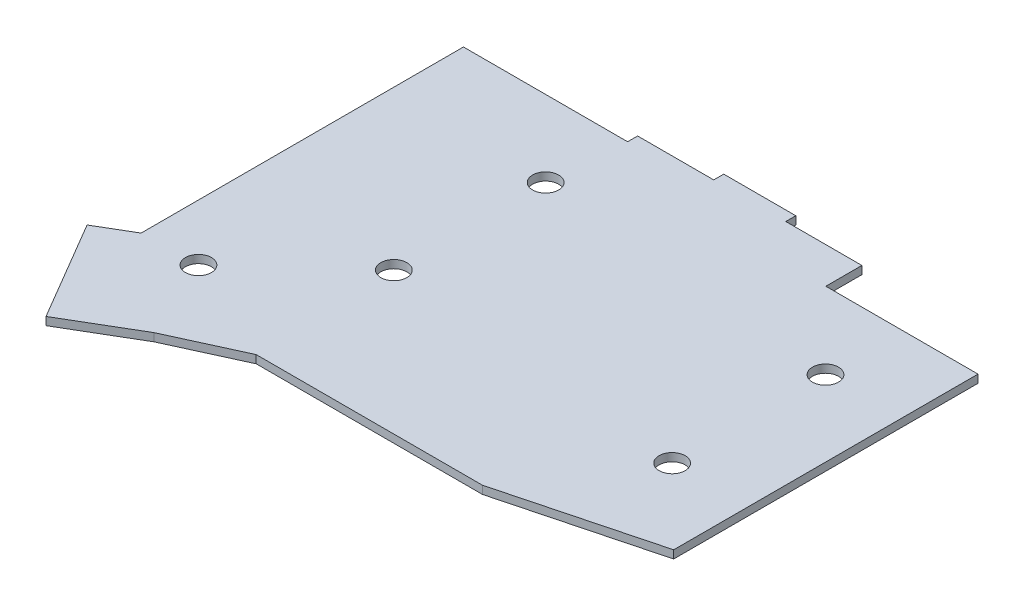
ISO-10303-21;
HEADER;
FILE_DESCRIPTION(('STEP AP214'),'2;1');
FILE_NAME('part.step','',(''),(''),'','','');
FILE_SCHEMA(('AUTOMOTIVE_DESIGN { 1 0 10303 214 1 1 1 1 }'));
ENDSEC;
DATA;
#1=APPLICATION_CONTEXT('core data for automotive mechanical design processes');
#2=APPLICATION_PROTOCOL_DEFINITION('international standard','automotive_design',2000,#1);
#3=PRODUCT_CONTEXT('',#1,'mechanical');
#4=PRODUCT('Part','Part','',(#3));
#5=PRODUCT_RELATED_PRODUCT_CATEGORY('part','',(#4));
#6=PRODUCT_DEFINITION_FORMATION('','',#4);
#7=PRODUCT_DEFINITION_CONTEXT('part definition',#1,'design');
#8=PRODUCT_DEFINITION('design','',#6,#7);
#9=PRODUCT_DEFINITION_SHAPE('','',#8);
#10=(LENGTH_UNIT() NAMED_UNIT(*) SI_UNIT(.MILLI.,.METRE.));
#11=(NAMED_UNIT(*) PLANE_ANGLE_UNIT() SI_UNIT($,.RADIAN.));
#12=(NAMED_UNIT(*) SI_UNIT($,.STERADIAN.) SOLID_ANGLE_UNIT());
#13=UNCERTAINTY_MEASURE_WITH_UNIT(LENGTH_MEASURE(1.E-05),#10,'distance_accuracy_value','');
#14=(GEOMETRIC_REPRESENTATION_CONTEXT(3) GLOBAL_UNCERTAINTY_ASSIGNED_CONTEXT((#13)) GLOBAL_UNIT_ASSIGNED_CONTEXT((#10,
#11,#12)) REPRESENTATION_CONTEXT('',''));
#15=CARTESIAN_POINT('',(0.,0.,0.));
#16=DIRECTION('',(0.,0.,1.));
#17=DIRECTION('',(1.,0.,0.));
#18=AXIS2_PLACEMENT_3D('',#15,#16,#17);
#19=CARTESIAN_POINT('',(0.,2.,0.));
#20=DIRECTION('',(0.,1.,0.));
#21=DIRECTION('',(0.,0.,1.));
#22=AXIS2_PLACEMENT_3D('',#19,#20,#21);
#23=PLANE('',#22);
#24=CARTESIAN_POINT('',(116.07,2.,25.658));
#25=DIRECTION('',(0.,1.,0.));
#26=DIRECTION('',(0.,0.,1.));
#27=AXIS2_PLACEMENT_3D('',#24,#25,#26);
#28=CIRCLE('',#27,3.25000000000001);
#29=CARTESIAN_POINT('',(116.07,2.,28.908));
#30=VERTEX_POINT('',#29);
#31=EDGE_CURVE('E362',#30,#30,#28,.T.);
#32=ORIENTED_EDGE('',*,*,#31,.F.);
#33=EDGE_LOOP('',(#32));
#34=FACE_BOUND('',#33,.T.);
#35=CARTESIAN_POINT('',(39.57,2.,56.958));
#36=DIRECTION('',(0.,1.,0.));
#37=DIRECTION('',(0.,0.,1.));
#38=AXIS2_PLACEMENT_3D('',#35,#36,#37);
#39=CIRCLE('',#38,3.25);
#40=CARTESIAN_POINT('',(39.57,2.,60.208));
#41=VERTEX_POINT('',#40);
#42=EDGE_CURVE('E374',#41,#41,#39,.T.);
#43=ORIENTED_EDGE('',*,*,#42,.F.);
#44=EDGE_LOOP('',(#43));
#45=FACE_BOUND('',#44,.T.);
#46=DIRECTION('',(-1.,0.,0.));
#47=VECTOR('',#46,1.);
#48=CARTESIAN_POINT('',(41.,2.,0.));
#49=LINE('',#48,#47);
#50=CARTESIAN_POINT('',(41.,2.,0.));
#51=VERTEX_POINT('',#50);
#52=CARTESIAN_POINT('',(0.,2.,0.));
#53=VERTEX_POINT('',#52);
#54=EDGE_CURVE('E219',#51,#53,#49,.T.);
#55=ORIENTED_EDGE('',*,*,#54,.T.);
#56=DIRECTION('',(0.,0.,1.));
#57=VECTOR('',#56,1.);
#58=CARTESIAN_POINT('',(0.,2.,0.));
#59=LINE('',#58,#57);
#60=CARTESIAN_POINT('',(0.,2.,80.5));
#61=VERTEX_POINT('',#60);
#62=EDGE_CURVE('E122',#53,#61,#59,.T.);
#63=ORIENTED_EDGE('',*,*,#62,.T.);
#64=DIRECTION('',(-0.861934215157769,0.,0.507020126563394));
#65=VECTOR('',#64,1.);
#66=CARTESIAN_POINT('',(0.,2.,80.5));
#67=LINE('',#66,#65);
#68=CARTESIAN_POINT('',(-8.5,2.,85.5));
#69=VERTEX_POINT('',#68);
#70=EDGE_CURVE('E261',#61,#69,#67,.T.);
#71=ORIENTED_EDGE('',*,*,#70,.T.);
#72=DIRECTION('',(0.507020126563394,0.,0.861934215157769));
#73=VECTOR('',#72,1.);
#74=CARTESIAN_POINT('',(-8.5,2.,85.5));
#75=LINE('',#74,#73);
#76=CARTESIAN_POINT('',(6.15323253246143,2.,110.410495305184));
#77=VERTEX_POINT('',#76);
#78=EDGE_CURVE('E280',#69,#77,#75,.T.);
#79=ORIENTED_EDGE('',*,*,#78,.T.);
#80=DIRECTION('',(0.861934215157769,0.,-0.507020126563395));
#81=VECTOR('',#80,1.);
#82=CARTESIAN_POINT('',(6.15323253246143,2.,110.410495305184));
#83=LINE('',#82,#81);
#84=CARTESIAN_POINT('',(23.1532325324614,2.,100.410495305184));
#85=VERTEX_POINT('',#84);
#86=EDGE_CURVE('E277',#77,#85,#83,.T.);
#87=ORIENTED_EDGE('',*,*,#86,.T.);
#88=DIRECTION('',(0.909474475585797,0.,-0.415759760267802));
#89=VECTOR('',#88,1.);
#90=CARTESIAN_POINT('',(23.1532325324614,2.,100.410495305184));
#91=LINE('',#90,#89);
#92=CARTESIAN_POINT('',(40.6532325324614,2.,92.4104953051842));
#93=VERTEX_POINT('',#92);
#94=EDGE_CURVE('E279',#85,#93,#91,.T.);
#95=ORIENTED_EDGE('',*,*,#94,.T.);
#96=DIRECTION('',(1.,0.,0.));
#97=VECTOR('',#96,1.);
#98=CARTESIAN_POINT('',(97.1532325324615,2.,92.4104953051843));
#99=LINE('',#98,#97);
#100=CARTESIAN_POINT('',(97.1532325324615,2.,92.4104953051843));
#101=VERTEX_POINT('',#100);
#102=EDGE_CURVE('E282',#93,#101,#99,.T.);
#103=ORIENTED_EDGE('',*,*,#102,.T.);
#104=DIRECTION('',(0.967383206480212,0.,-0.253317452655881));
#105=VECTOR('',#104,1.);
#106=CARTESIAN_POINT('',(135.,2.,82.5));
#107=LINE('',#106,#105);
#108=CARTESIAN_POINT('',(135.,2.,82.5));
#109=VERTEX_POINT('',#108);
#110=EDGE_CURVE('E288',#101,#109,#107,.T.);
#111=ORIENTED_EDGE('',*,*,#110,.T.);
#112=DIRECTION('',(0.,0.,-1.));
#113=VECTOR('',#112,1.);
#114=CARTESIAN_POINT('',(135.,2.,6.5));
#115=LINE('',#114,#113);
#116=CARTESIAN_POINT('',(135.,2.,6.5));
#117=VERTEX_POINT('',#116);
#118=EDGE_CURVE('E290',#109,#117,#115,.T.);
#119=ORIENTED_EDGE('',*,*,#118,.T.);
#120=DIRECTION('',(-1.,0.,0.));
#121=VECTOR('',#120,1.);
#122=CARTESIAN_POINT('',(97.,2.,6.5));
#123=LINE('',#122,#121);
#124=CARTESIAN_POINT('',(97.,2.,6.5));
#125=VERTEX_POINT('',#124);
#126=EDGE_CURVE('E292',#117,#125,#123,.T.);
#127=ORIENTED_EDGE('',*,*,#126,.T.);
#128=DIRECTION('',(0.,0.,-1.));
#129=VECTOR('',#128,1.);
#130=CARTESIAN_POINT('',(97.,2.,-2.5));
#131=LINE('',#130,#129);
#132=CARTESIAN_POINT('',(97.,2.,-2.5));
#133=VERTEX_POINT('',#132);
#134=EDGE_CURVE('E294',#125,#133,#131,.T.);
#135=ORIENTED_EDGE('',*,*,#134,.T.);
#136=DIRECTION('',(-1.,0.,0.));
#137=VECTOR('',#136,1.);
#138=CARTESIAN_POINT('',(78.,2.,-2.5));
#139=LINE('',#138,#137);
#140=CARTESIAN_POINT('',(78.,2.,-2.5));
#141=VERTEX_POINT('',#140);
#142=EDGE_CURVE('E296',#133,#141,#139,.T.);
#143=ORIENTED_EDGE('',*,*,#142,.T.);
#144=DIRECTION('',(0.,0.,-1.));
#145=VECTOR('',#144,1.);
#146=CARTESIAN_POINT('',(78.,2.,-5.));
#147=LINE('',#146,#145);
#148=CARTESIAN_POINT('',(78.,2.,-5.));
#149=VERTEX_POINT('',#148);
#150=EDGE_CURVE('E298',#141,#149,#147,.T.);
#151=ORIENTED_EDGE('',*,*,#150,.T.);
#152=DIRECTION('',(-1.,0.,0.));
#153=VECTOR('',#152,1.);
#154=CARTESIAN_POINT('',(60.,2.,-5.));
#155=LINE('',#154,#153);
#156=CARTESIAN_POINT('',(60.,2.,-5.));
#157=VERTEX_POINT('',#156);
#158=EDGE_CURVE('E168',#149,#157,#155,.T.);
#159=ORIENTED_EDGE('',*,*,#158,.T.);
#160=DIRECTION('',(0.,0.,1.));
#161=VECTOR('',#160,1.);
#162=CARTESIAN_POINT('',(60.,2.,-2.5));
#163=LINE('',#162,#161);
#164=CARTESIAN_POINT('',(60.,2.,-2.5));
#165=VERTEX_POINT('',#164);
#166=EDGE_CURVE('E162',#157,#165,#163,.T.);
#167=ORIENTED_EDGE('',*,*,#166,.T.);
#168=DIRECTION('',(-1.,0.,0.));
#169=VECTOR('',#168,1.);
#170=CARTESIAN_POINT('',(41.,2.,-2.5));
#171=LINE('',#170,#169);
#172=CARTESIAN_POINT('',(41.,2.,-2.5));
#173=VERTEX_POINT('',#172);
#174=EDGE_CURVE('E166',#165,#173,#171,.T.);
#175=ORIENTED_EDGE('',*,*,#174,.T.);
#176=DIRECTION('',(0.,0.,1.));
#177=VECTOR('',#176,1.);
#178=CARTESIAN_POINT('',(41.,2.,0.));
#179=LINE('',#178,#177);
#180=EDGE_CURVE('E52',#173,#51,#179,.T.);
#181=ORIENTED_EDGE('',*,*,#180,.T.);
#182=EDGE_LOOP('',(#55,#63,#71,#79,#87,#95,#103,#111,#119,#127,#135,#143,#151,#159,#167,#175,#181));
#183=FACE_BOUND('',#182,.T.);
#184=CARTESIAN_POINT('',(14.07,2.,80.258));
#185=DIRECTION('',(0.,1.,0.));
#186=DIRECTION('',(0.,0.,1.));
#187=AXIS2_PLACEMENT_3D('',#184,#185,#186);
#188=CIRCLE('',#187,3.25);
#189=CARTESIAN_POINT('',(14.07,2.,83.508));
#190=VERTEX_POINT('',#189);
#191=EDGE_CURVE('E190',#190,#190,#188,.T.);
#192=ORIENTED_EDGE('',*,*,#191,.F.);
#193=EDGE_LOOP('',(#192));
#194=FACE_BOUND('',#193,.T.);
#195=CARTESIAN_POINT('',(116.07,2.,63.958));
#196=DIRECTION('',(0.,1.,0.));
#197=DIRECTION('',(0.,0.,1.));
#198=AXIS2_PLACEMENT_3D('',#195,#196,#197);
#199=CIRCLE('',#198,3.25000000000001);
#200=CARTESIAN_POINT('',(116.07,2.,67.208));
#201=VERTEX_POINT('',#200);
#202=EDGE_CURVE('E368',#201,#201,#199,.T.);
#203=ORIENTED_EDGE('',*,*,#202,.F.);
#204=EDGE_LOOP('',(#203));
#205=FACE_BOUND('',#204,.T.);
#206=CARTESIAN_POINT('',(39.57,2.,19.048));
#207=DIRECTION('',(0.,1.,0.));
#208=DIRECTION('',(0.,0.,1.));
#209=AXIS2_PLACEMENT_3D('',#206,#207,#208);
#210=CIRCLE('',#209,3.25);
#211=CARTESIAN_POINT('',(39.57,2.,22.298));
#212=VERTEX_POINT('',#211);
#213=EDGE_CURVE('E353',#212,#212,#210,.T.);
#214=ORIENTED_EDGE('',*,*,#213,.F.);
#215=EDGE_LOOP('',(#214));
#216=FACE_BOUND('',#215,.T.);
#217=ADVANCED_FACE('F35',(#34,#45,#183,#194,#205,#216),#23,.T.);
#218=CARTESIAN_POINT('',(0.,0.,0.));
#219=DIRECTION('',(0.,1.,0.));
#220=DIRECTION('',(0.,0.,1.));
#221=AXIS2_PLACEMENT_3D('',#218,#219,#220);
#222=PLANE('',#221);
#223=DIRECTION('',(-1.,0.,0.));
#224=VECTOR('',#223,1.);
#225=CARTESIAN_POINT('',(41.,0.,0.));
#226=LINE('',#225,#224);
#227=CARTESIAN_POINT('',(41.,0.,0.));
#228=VERTEX_POINT('',#227);
#229=CARTESIAN_POINT('',(0.,0.,0.));
#230=VERTEX_POINT('',#229);
#231=EDGE_CURVE('E186',#228,#230,#226,.T.);
#232=ORIENTED_EDGE('',*,*,#231,.F.);
#233=DIRECTION('',(0.,0.,1.));
#234=VECTOR('',#233,1.);
#235=CARTESIAN_POINT('',(41.,0.,0.));
#236=LINE('',#235,#234);
#237=CARTESIAN_POINT('',(41.,0.,-2.5));
#238=VERTEX_POINT('',#237);
#239=EDGE_CURVE('E114',#238,#228,#236,.T.);
#240=ORIENTED_EDGE('',*,*,#239,.F.);
#241=DIRECTION('',(-1.,0.,0.));
#242=VECTOR('',#241,1.);
#243=CARTESIAN_POINT('',(41.,0.,-2.5));
#244=LINE('',#243,#242);
#245=CARTESIAN_POINT('',(60.,0.,-2.5));
#246=VERTEX_POINT('',#245);
#247=EDGE_CURVE('E108',#246,#238,#244,.T.);
#248=ORIENTED_EDGE('',*,*,#247,.F.);
#249=DIRECTION('',(0.,0.,1.));
#250=VECTOR('',#249,1.);
#251=CARTESIAN_POINT('',(60.,0.,-2.5));
#252=LINE('',#251,#250);
#253=CARTESIAN_POINT('',(60.,0.,-5.));
#254=VERTEX_POINT('',#253);
#255=EDGE_CURVE('E176',#254,#246,#252,.T.);
#256=ORIENTED_EDGE('',*,*,#255,.F.);
#257=DIRECTION('',(-1.,0.,0.));
#258=VECTOR('',#257,1.);
#259=CARTESIAN_POINT('',(60.,0.,-5.));
#260=LINE('',#259,#258);
#261=CARTESIAN_POINT('',(78.,0.,-5.));
#262=VERTEX_POINT('',#261);
#263=EDGE_CURVE('E214',#262,#254,#260,.T.);
#264=ORIENTED_EDGE('',*,*,#263,.F.);
#265=DIRECTION('',(0.,0.,-1.));
#266=VECTOR('',#265,1.);
#267=CARTESIAN_POINT('',(78.,0.,-5.));
#268=LINE('',#267,#266);
#269=CARTESIAN_POINT('',(78.,0.,-2.5));
#270=VERTEX_POINT('',#269);
#271=EDGE_CURVE('E212',#270,#262,#268,.T.);
#272=ORIENTED_EDGE('',*,*,#271,.F.);
#273=DIRECTION('',(-1.,0.,0.));
#274=VECTOR('',#273,1.);
#275=CARTESIAN_POINT('',(78.,0.,-2.5));
#276=LINE('',#275,#274);
#277=CARTESIAN_POINT('',(97.,0.,-2.5));
#278=VERTEX_POINT('',#277);
#279=EDGE_CURVE('E210',#278,#270,#276,.T.);
#280=ORIENTED_EDGE('',*,*,#279,.F.);
#281=DIRECTION('',(0.,0.,-1.));
#282=VECTOR('',#281,1.);
#283=CARTESIAN_POINT('',(97.,0.,-2.5));
#284=LINE('',#283,#282);
#285=CARTESIAN_POINT('',(97.,0.,6.5));
#286=VERTEX_POINT('',#285);
#287=EDGE_CURVE('E208',#286,#278,#284,.T.);
#288=ORIENTED_EDGE('',*,*,#287,.F.);
#289=DIRECTION('',(-1.,0.,0.));
#290=VECTOR('',#289,1.);
#291=CARTESIAN_POINT('',(97.,0.,6.5));
#292=LINE('',#291,#290);
#293=CARTESIAN_POINT('',(135.,0.,6.5));
#294=VERTEX_POINT('',#293);
#295=EDGE_CURVE('E206',#294,#286,#292,.T.);
#296=ORIENTED_EDGE('',*,*,#295,.F.);
#297=DIRECTION('',(0.,0.,-1.));
#298=VECTOR('',#297,1.);
#299=CARTESIAN_POINT('',(135.,0.,6.5));
#300=LINE('',#299,#298);
#301=CARTESIAN_POINT('',(135.,0.,82.5));
#302=VERTEX_POINT('',#301);
#303=EDGE_CURVE('E204',#302,#294,#300,.T.);
#304=ORIENTED_EDGE('',*,*,#303,.F.);
#305=DIRECTION('',(0.967383206480212,0.,-0.253317452655881));
#306=VECTOR('',#305,1.);
#307=CARTESIAN_POINT('',(135.,0.,82.5));
#308=LINE('',#307,#306);
#309=CARTESIAN_POINT('',(97.1532325324615,0.,92.4104953051843));
#310=VERTEX_POINT('',#309);
#311=EDGE_CURVE('E202',#310,#302,#308,.T.);
#312=ORIENTED_EDGE('',*,*,#311,.F.);
#313=DIRECTION('',(1.,0.,0.));
#314=VECTOR('',#313,1.);
#315=CARTESIAN_POINT('',(97.1532325324615,0.,92.4104953051843));
#316=LINE('',#315,#314);
#317=CARTESIAN_POINT('',(40.6532325324614,0.,92.4104953051842));
#318=VERTEX_POINT('',#317);
#319=EDGE_CURVE('E200',#318,#310,#316,.T.);
#320=ORIENTED_EDGE('',*,*,#319,.F.);
#321=DIRECTION('',(0.909474475585797,0.,-0.415759760267802));
#322=VECTOR('',#321,1.);
#323=CARTESIAN_POINT('',(23.1532325324614,0.,100.410495305184));
#324=LINE('',#323,#322);
#325=CARTESIAN_POINT('',(23.1532325324614,0.,100.410495305184));
#326=VERTEX_POINT('',#325);
#327=EDGE_CURVE('E198',#326,#318,#324,.T.);
#328=ORIENTED_EDGE('',*,*,#327,.F.);
#329=DIRECTION('',(0.861934215157769,0.,-0.507020126563395));
#330=VECTOR('',#329,1.);
#331=CARTESIAN_POINT('',(6.15323253246143,0.,110.410495305184));
#332=LINE('',#331,#330);
#333=CARTESIAN_POINT('',(6.15323253246143,0.,110.410495305184));
#334=VERTEX_POINT('',#333);
#335=EDGE_CURVE('E196',#334,#326,#332,.T.);
#336=ORIENTED_EDGE('',*,*,#335,.F.);
#337=DIRECTION('',(0.507020126563394,0.,0.861934215157769));
#338=VECTOR('',#337,1.);
#339=CARTESIAN_POINT('',(-8.5,0.,85.5));
#340=LINE('',#339,#338);
#341=CARTESIAN_POINT('',(-8.5,0.,85.5));
#342=VERTEX_POINT('',#341);
#343=EDGE_CURVE('E194',#342,#334,#340,.T.);
#344=ORIENTED_EDGE('',*,*,#343,.F.);
#345=DIRECTION('',(-0.861934215157769,0.,0.507020126563394));
#346=VECTOR('',#345,1.);
#347=CARTESIAN_POINT('',(0.,0.,80.5));
#348=LINE('',#347,#346);
#349=CARTESIAN_POINT('',(0.,0.,80.5));
#350=VERTEX_POINT('',#349);
#351=EDGE_CURVE('E192',#350,#342,#348,.T.);
#352=ORIENTED_EDGE('',*,*,#351,.F.);
#353=DIRECTION('',(0.,0.,1.));
#354=VECTOR('',#353,1.);
#355=CARTESIAN_POINT('',(0.,0.,0.));
#356=LINE('',#355,#354);
#357=EDGE_CURVE('E189',#230,#350,#356,.T.);
#358=ORIENTED_EDGE('',*,*,#357,.F.);
#359=EDGE_LOOP('',(#232,#240,#248,#256,#264,#272,#280,#288,#296,#304,#312,#320,#328,#336,#344,
#352,#358));
#360=FACE_BOUND('',#359,.T.);
#361=CARTESIAN_POINT('',(14.07,0.,80.258));
#362=DIRECTION('',(0.,1.,0.));
#363=DIRECTION('',(0.,0.,1.));
#364=AXIS2_PLACEMENT_3D('',#361,#362,#363);
#365=CIRCLE('',#364,3.25);
#366=CARTESIAN_POINT('',(14.07,0.,83.508));
#367=VERTEX_POINT('',#366);
#368=EDGE_CURVE('E377',#367,#367,#365,.T.);
#369=ORIENTED_EDGE('',*,*,#368,.T.);
#370=EDGE_LOOP('',(#369));
#371=FACE_BOUND('',#370,.T.);
#372=CARTESIAN_POINT('',(39.57,0.,56.958));
#373=DIRECTION('',(0.,1.,0.));
#374=DIRECTION('',(0.,0.,1.));
#375=AXIS2_PLACEMENT_3D('',#372,#373,#374);
#376=CIRCLE('',#375,3.25);
#377=CARTESIAN_POINT('',(39.57,0.,60.208));
#378=VERTEX_POINT('',#377);
#379=EDGE_CURVE('E371',#378,#378,#376,.T.);
#380=ORIENTED_EDGE('',*,*,#379,.T.);
#381=EDGE_LOOP('',(#380));
#382=FACE_BOUND('',#381,.T.);
#383=CARTESIAN_POINT('',(116.07,0.,63.958));
#384=DIRECTION('',(0.,1.,0.));
#385=DIRECTION('',(0.,0.,1.));
#386=AXIS2_PLACEMENT_3D('',#383,#384,#385);
#387=CIRCLE('',#386,3.25000000000001);
#388=CARTESIAN_POINT('',(116.07,0.,67.208));
#389=VERTEX_POINT('',#388);
#390=EDGE_CURVE('E365',#389,#389,#387,.T.);
#391=ORIENTED_EDGE('',*,*,#390,.T.);
#392=EDGE_LOOP('',(#391));
#393=FACE_BOUND('',#392,.T.);
#394=CARTESIAN_POINT('',(116.07,0.,25.658));
#395=DIRECTION('',(0.,1.,0.));
#396=DIRECTION('',(0.,0.,1.));
#397=AXIS2_PLACEMENT_3D('',#394,#395,#396);
#398=CIRCLE('',#397,3.25000000000001);
#399=CARTESIAN_POINT('',(116.07,0.,28.908));
#400=VERTEX_POINT('',#399);
#401=EDGE_CURVE('E359',#400,#400,#398,.T.);
#402=ORIENTED_EDGE('',*,*,#401,.T.);
#403=EDGE_LOOP('',(#402));
#404=FACE_BOUND('',#403,.T.);
#405=CARTESIAN_POINT('',(39.57,0.,19.048));
#406=DIRECTION('',(0.,1.,0.));
#407=DIRECTION('',(0.,0.,1.));
#408=AXIS2_PLACEMENT_3D('',#405,#406,#407);
#409=CIRCLE('',#408,3.25);
#410=CARTESIAN_POINT('',(39.57,0.,22.298));
#411=VERTEX_POINT('',#410);
#412=EDGE_CURVE('E356',#411,#411,#409,.T.);
#413=ORIENTED_EDGE('',*,*,#412,.T.);
#414=EDGE_LOOP('',(#413));
#415=FACE_BOUND('',#414,.T.);
#416=ADVANCED_FACE('F265',(#360,#371,#382,#393,#404,#415),#222,.F.);
#417=CARTESIAN_POINT('',(41.,2.,0.));
#418=DIRECTION('',(0.,0.,1.));
#419=DIRECTION('',(1.,0.,0.));
#420=AXIS2_PLACEMENT_3D('',#417,#418,#419);
#421=PLANE('',#420);
#422=ORIENTED_EDGE('',*,*,#231,.T.);
#423=DIRECTION('',(0.,-1.,0.));
#424=VECTOR('',#423,1.);
#425=CARTESIAN_POINT('',(0.,2.,0.));
#426=LINE('',#425,#424);
#427=EDGE_CURVE('E11',#53,#230,#426,.T.);
#428=ORIENTED_EDGE('',*,*,#427,.F.);
#429=ORIENTED_EDGE('',*,*,#54,.F.);
#430=DIRECTION('',(0.,-1.,0.));
#431=VECTOR('',#430,1.);
#432=CARTESIAN_POINT('',(41.,2.,0.));
#433=LINE('',#432,#431);
#434=EDGE_CURVE('E182',#51,#228,#433,.T.);
#435=ORIENTED_EDGE('',*,*,#434,.T.);
#436=EDGE_LOOP('',(#422,#428,#429,#435));
#437=FACE_BOUND('',#436,.T.);
#438=ADVANCED_FACE('F37',(#437),#421,.F.);
#439=CARTESIAN_POINT('',(0.,2.,0.));
#440=DIRECTION('',(1.,0.,0.));
#441=DIRECTION('',(0.,0.,-1.));
#442=AXIS2_PLACEMENT_3D('',#439,#440,#441);
#443=PLANE('',#442);
#444=ORIENTED_EDGE('',*,*,#357,.T.);
#445=DIRECTION('',(0.,-1.,0.));
#446=VECTOR('',#445,1.);
#447=CARTESIAN_POINT('',(0.,2.,80.5));
#448=LINE('',#447,#446);
#449=EDGE_CURVE('E44',#61,#350,#448,.T.);
#450=ORIENTED_EDGE('',*,*,#449,.F.);
#451=ORIENTED_EDGE('',*,*,#62,.F.);
#452=ORIENTED_EDGE('',*,*,#427,.T.);
#453=EDGE_LOOP('',(#444,#450,#451,#452));
#454=FACE_BOUND('',#453,.T.);
#455=ADVANCED_FACE('F546',(#454),#443,.F.);
#456=CARTESIAN_POINT('',(0.,2.,80.5));
#457=DIRECTION('',(0.507020126563394,0.,0.861934215157769));
#458=DIRECTION('',(0.861934215157769,0.,-0.507020126563394));
#459=AXIS2_PLACEMENT_3D('',#456,#457,#458);
#460=PLANE('',#459);
#461=ORIENTED_EDGE('',*,*,#351,.T.);
#462=DIRECTION('',(0.,-1.,0.));
#463=VECTOR('',#462,1.);
#464=CARTESIAN_POINT('',(-8.5,2.,85.5));
#465=LINE('',#464,#463);
#466=EDGE_CURVE('E253',#69,#342,#465,.T.);
#467=ORIENTED_EDGE('',*,*,#466,.F.);
#468=ORIENTED_EDGE('',*,*,#70,.F.);
#469=ORIENTED_EDGE('',*,*,#449,.T.);
#470=EDGE_LOOP('',(#461,#467,#468,#469));
#471=FACE_BOUND('',#470,.T.);
#472=ADVANCED_FACE('F259',(#471),#460,.F.);
#473=CARTESIAN_POINT('',(-8.5,2.,85.5));
#474=DIRECTION('',(0.861934215157769,0.,-0.507020126563394));
#475=DIRECTION('',(-0.507020126563395,0.,-0.861934215157769));
#476=AXIS2_PLACEMENT_3D('',#473,#474,#475);
#477=PLANE('',#476);
#478=ORIENTED_EDGE('',*,*,#343,.T.);
#479=DIRECTION('',(0.,-1.,0.));
#480=VECTOR('',#479,1.);
#481=CARTESIAN_POINT('',(6.15323253246143,2.,110.410495305184));
#482=LINE('',#481,#480);
#483=EDGE_CURVE('E250',#77,#334,#482,.T.);
#484=ORIENTED_EDGE('',*,*,#483,.F.);
#485=ORIENTED_EDGE('',*,*,#78,.F.);
#486=ORIENTED_EDGE('',*,*,#466,.T.);
#487=EDGE_LOOP('',(#478,#484,#485,#486));
#488=FACE_BOUND('',#487,.T.);
#489=ADVANCED_FACE('F271',(#488),#477,.F.);
#490=CARTESIAN_POINT('',(6.15323253246143,2.,110.410495305184));
#491=DIRECTION('',(-0.507020126563395,0.,-0.861934215157769));
#492=DIRECTION('',(-0.861934215157769,0.,0.507020126563395));
#493=AXIS2_PLACEMENT_3D('',#490,#491,#492);
#494=PLANE('',#493);
#495=ORIENTED_EDGE('',*,*,#335,.T.);
#496=DIRECTION('',(0.,-1.,0.));
#497=VECTOR('',#496,1.);
#498=CARTESIAN_POINT('',(23.1532325324614,2.,100.410495305184));
#499=LINE('',#498,#497);
#500=EDGE_CURVE('E247',#85,#326,#499,.T.);
#501=ORIENTED_EDGE('',*,*,#500,.F.);
#502=ORIENTED_EDGE('',*,*,#86,.F.);
#503=ORIENTED_EDGE('',*,*,#483,.T.);
#504=EDGE_LOOP('',(#495,#501,#502,#503));
#505=FACE_BOUND('',#504,.T.);
#506=ADVANCED_FACE('F275',(#505),#494,.F.);
#507=CARTESIAN_POINT('',(23.1532325324614,2.,100.410495305184));
#508=DIRECTION('',(-0.415759760267802,0.,-0.909474475585797));
#509=DIRECTION('',(-0.909474475585797,0.,0.415759760267802));
#510=AXIS2_PLACEMENT_3D('',#507,#508,#509);
#511=PLANE('',#510);
#512=ORIENTED_EDGE('',*,*,#327,.T.);
#513=DIRECTION('',(0.,-1.,0.));
#514=VECTOR('',#513,1.);
#515=CARTESIAN_POINT('',(40.6532325324614,2.,92.4104953051842));
#516=LINE('',#515,#514);
#517=EDGE_CURVE('E244',#93,#318,#516,.T.);
#518=ORIENTED_EDGE('',*,*,#517,.F.);
#519=ORIENTED_EDGE('',*,*,#94,.F.);
#520=ORIENTED_EDGE('',*,*,#500,.T.);
#521=EDGE_LOOP('',(#512,#518,#519,#520));
#522=FACE_BOUND('',#521,.T.);
#523=ADVANCED_FACE('F511',(#522),#511,.F.);
#524=CARTESIAN_POINT('',(97.1532325324615,2.,92.4104953051843));
#525=DIRECTION('',(0.,0.,-1.));
#526=DIRECTION('',(-1.,0.,0.));
#527=AXIS2_PLACEMENT_3D('',#524,#525,#526);
#528=PLANE('',#527);
#529=ORIENTED_EDGE('',*,*,#319,.T.);
#530=DIRECTION('',(0.,-1.,0.));
#531=VECTOR('',#530,1.);
#532=CARTESIAN_POINT('',(97.1532325324615,2.,92.4104953051843));
#533=LINE('',#532,#531);
#534=EDGE_CURVE('E241',#101,#310,#533,.T.);
#535=ORIENTED_EDGE('',*,*,#534,.F.);
#536=ORIENTED_EDGE('',*,*,#102,.F.);
#537=ORIENTED_EDGE('',*,*,#517,.T.);
#538=EDGE_LOOP('',(#529,#535,#536,#537));
#539=FACE_BOUND('',#538,.T.);
#540=ADVANCED_FACE('F501',(#539),#528,.F.);
#541=CARTESIAN_POINT('',(135.,2.,82.5));
#542=DIRECTION('',(-0.253317452655881,0.,-0.967383206480212));
#543=DIRECTION('',(-0.967383206480212,0.,0.253317452655881));
#544=AXIS2_PLACEMENT_3D('',#541,#542,#543);
#545=PLANE('',#544);
#546=ORIENTED_EDGE('',*,*,#311,.T.);
#547=DIRECTION('',(0.,-1.,0.));
#548=VECTOR('',#547,1.);
#549=CARTESIAN_POINT('',(135.,2.,82.5));
#550=LINE('',#549,#548);
#551=EDGE_CURVE('E238',#109,#302,#550,.T.);
#552=ORIENTED_EDGE('',*,*,#551,.F.);
#553=ORIENTED_EDGE('',*,*,#110,.F.);
#554=ORIENTED_EDGE('',*,*,#534,.T.);
#555=EDGE_LOOP('',(#546,#552,#553,#554));
#556=FACE_BOUND('',#555,.T.);
#557=ADVANCED_FACE('F491',(#556),#545,.F.);
#558=CARTESIAN_POINT('',(135.,2.,6.5));
#559=DIRECTION('',(-1.,0.,0.));
#560=DIRECTION('',(0.,0.,1.));
#561=AXIS2_PLACEMENT_3D('',#558,#559,#560);
#562=PLANE('',#561);
#563=ORIENTED_EDGE('',*,*,#303,.T.);
#564=DIRECTION('',(0.,-1.,0.));
#565=VECTOR('',#564,1.);
#566=CARTESIAN_POINT('',(135.,2.,6.5));
#567=LINE('',#566,#565);
#568=EDGE_CURVE('E235',#117,#294,#567,.T.);
#569=ORIENTED_EDGE('',*,*,#568,.F.);
#570=ORIENTED_EDGE('',*,*,#118,.F.);
#571=ORIENTED_EDGE('',*,*,#551,.T.);
#572=EDGE_LOOP('',(#563,#569,#570,#571));
#573=FACE_BOUND('',#572,.T.);
#574=ADVANCED_FACE('F481',(#573),#562,.F.);
#575=CARTESIAN_POINT('',(97.,2.,6.5));
#576=DIRECTION('',(0.,0.,1.));
#577=DIRECTION('',(1.,0.,0.));
#578=AXIS2_PLACEMENT_3D('',#575,#576,#577);
#579=PLANE('',#578);
#580=ORIENTED_EDGE('',*,*,#295,.T.);
#581=DIRECTION('',(0.,-1.,0.));
#582=VECTOR('',#581,1.);
#583=CARTESIAN_POINT('',(97.,2.,6.5));
#584=LINE('',#583,#582);
#585=EDGE_CURVE('E232',#125,#286,#584,.T.);
#586=ORIENTED_EDGE('',*,*,#585,.F.);
#587=ORIENTED_EDGE('',*,*,#126,.F.);
#588=ORIENTED_EDGE('',*,*,#568,.T.);
#589=EDGE_LOOP('',(#580,#586,#587,#588));
#590=FACE_BOUND('',#589,.T.);
#591=ADVANCED_FACE('F471',(#590),#579,.F.);
#592=CARTESIAN_POINT('',(97.,2.,-2.5));
#593=DIRECTION('',(-1.,0.,0.));
#594=DIRECTION('',(0.,0.,1.));
#595=AXIS2_PLACEMENT_3D('',#592,#593,#594);
#596=PLANE('',#595);
#597=ORIENTED_EDGE('',*,*,#287,.T.);
#598=DIRECTION('',(0.,-1.,0.));
#599=VECTOR('',#598,1.);
#600=CARTESIAN_POINT('',(97.,2.,-2.5));
#601=LINE('',#600,#599);
#602=EDGE_CURVE('E229',#133,#278,#601,.T.);
#603=ORIENTED_EDGE('',*,*,#602,.F.);
#604=ORIENTED_EDGE('',*,*,#134,.F.);
#605=ORIENTED_EDGE('',*,*,#585,.T.);
#606=EDGE_LOOP('',(#597,#603,#604,#605));
#607=FACE_BOUND('',#606,.T.);
#608=ADVANCED_FACE('F461',(#607),#596,.F.);
#609=CARTESIAN_POINT('',(78.,2.,-2.5));
#610=DIRECTION('',(0.,0.,1.));
#611=DIRECTION('',(1.,0.,0.));
#612=AXIS2_PLACEMENT_3D('',#609,#610,#611);
#613=PLANE('',#612);
#614=ORIENTED_EDGE('',*,*,#279,.T.);
#615=DIRECTION('',(0.,-1.,0.));
#616=VECTOR('',#615,1.);
#617=CARTESIAN_POINT('',(78.,2.,-2.5));
#618=LINE('',#617,#616);
#619=EDGE_CURVE('E226',#141,#270,#618,.T.);
#620=ORIENTED_EDGE('',*,*,#619,.F.);
#621=ORIENTED_EDGE('',*,*,#142,.F.);
#622=ORIENTED_EDGE('',*,*,#602,.T.);
#623=EDGE_LOOP('',(#614,#620,#621,#622));
#624=FACE_BOUND('',#623,.T.);
#625=ADVANCED_FACE('F452',(#624),#613,.F.);
#626=CARTESIAN_POINT('',(78.,2.,-5.));
#627=DIRECTION('',(-1.,0.,0.));
#628=DIRECTION('',(0.,0.,1.));
#629=AXIS2_PLACEMENT_3D('',#626,#627,#628);
#630=PLANE('',#629);
#631=ORIENTED_EDGE('',*,*,#271,.T.);
#632=DIRECTION('',(0.,-1.,0.));
#633=VECTOR('',#632,1.);
#634=CARTESIAN_POINT('',(78.,2.,-5.));
#635=LINE('',#634,#633);
#636=EDGE_CURVE('E223',#149,#262,#635,.T.);
#637=ORIENTED_EDGE('',*,*,#636,.F.);
#638=ORIENTED_EDGE('',*,*,#150,.F.);
#639=ORIENTED_EDGE('',*,*,#619,.T.);
#640=EDGE_LOOP('',(#631,#637,#638,#639));
#641=FACE_BOUND('',#640,.T.);
#642=ADVANCED_FACE('F304',(#641),#630,.F.);
#643=CARTESIAN_POINT('',(60.,2.,-5.));
#644=DIRECTION('',(0.,0.,1.));
#645=DIRECTION('',(1.,0.,0.));
#646=AXIS2_PLACEMENT_3D('',#643,#644,#645);
#647=PLANE('',#646);
#648=ORIENTED_EDGE('',*,*,#263,.T.);
#649=DIRECTION('',(0.,-1.,0.));
#650=VECTOR('',#649,1.);
#651=CARTESIAN_POINT('',(60.,2.,-5.));
#652=LINE('',#651,#650);
#653=EDGE_CURVE('E177',#157,#254,#652,.T.);
#654=ORIENTED_EDGE('',*,*,#653,.F.);
#655=ORIENTED_EDGE('',*,*,#158,.F.);
#656=ORIENTED_EDGE('',*,*,#636,.T.);
#657=EDGE_LOOP('',(#648,#654,#655,#656));
#658=FACE_BOUND('',#657,.T.);
#659=ADVANCED_FACE('F308',(#658),#647,.F.);
#660=CARTESIAN_POINT('',(60.,2.,-2.5));
#661=DIRECTION('',(1.,0.,0.));
#662=DIRECTION('',(0.,0.,-1.));
#663=AXIS2_PLACEMENT_3D('',#660,#661,#662);
#664=PLANE('',#663);
#665=ORIENTED_EDGE('',*,*,#255,.T.);
#666=DIRECTION('',(0.,-1.,0.));
#667=VECTOR('',#666,1.);
#668=CARTESIAN_POINT('',(60.,2.,-2.5));
#669=LINE('',#668,#667);
#670=EDGE_CURVE('E173',#165,#246,#669,.T.);
#671=ORIENTED_EDGE('',*,*,#670,.F.);
#672=ORIENTED_EDGE('',*,*,#166,.F.);
#673=ORIENTED_EDGE('',*,*,#653,.T.);
#674=EDGE_LOOP('',(#665,#671,#672,#673));
#675=FACE_BOUND('',#674,.T.);
#676=ADVANCED_FACE('F174',(#675),#664,.F.);
#677=CARTESIAN_POINT('',(41.,2.,-2.5));
#678=DIRECTION('',(0.,0.,1.));
#679=DIRECTION('',(1.,0.,0.));
#680=AXIS2_PLACEMENT_3D('',#677,#678,#679);
#681=PLANE('',#680);
#682=ORIENTED_EDGE('',*,*,#247,.T.);
#683=DIRECTION('',(0.,-1.,0.));
#684=VECTOR('',#683,1.);
#685=CARTESIAN_POINT('',(41.,2.,-2.5));
#686=LINE('',#685,#684);
#687=EDGE_CURVE('E178',#173,#238,#686,.T.);
#688=ORIENTED_EDGE('',*,*,#687,.F.);
#689=ORIENTED_EDGE('',*,*,#174,.F.);
#690=ORIENTED_EDGE('',*,*,#670,.T.);
#691=EDGE_LOOP('',(#682,#688,#689,#690));
#692=FACE_BOUND('',#691,.T.);
#693=ADVANCED_FACE('F180',(#692),#681,.F.);
#694=CARTESIAN_POINT('',(41.,2.,0.));
#695=DIRECTION('',(1.,0.,0.));
#696=DIRECTION('',(0.,0.,-1.));
#697=AXIS2_PLACEMENT_3D('',#694,#695,#696);
#698=PLANE('',#697);
#699=ORIENTED_EDGE('',*,*,#239,.T.);
#700=ORIENTED_EDGE('',*,*,#434,.F.);
#701=ORIENTED_EDGE('',*,*,#180,.F.);
#702=ORIENTED_EDGE('',*,*,#687,.T.);
#703=EDGE_LOOP('',(#699,#700,#701,#702));
#704=FACE_BOUND('',#703,.T.);
#705=ADVANCED_FACE('F312',(#704),#698,.F.);
#706=CARTESIAN_POINT('',(14.07,2.,80.258));
#707=DIRECTION('',(0.,-1.,0.));
#708=DIRECTION('',(0.,0.,-1.));
#709=AXIS2_PLACEMENT_3D('',#706,#707,#708);
#710=CYLINDRICAL_SURFACE('',#709,3.25);
#711=ORIENTED_EDGE('',*,*,#191,.T.);
#712=EDGE_LOOP('',(#711));
#713=FACE_BOUND('',#712,.T.);
#714=ORIENTED_EDGE('',*,*,#368,.F.);
#715=EDGE_LOOP('',(#714));
#716=FACE_BOUND('',#715,.T.);
#717=ADVANCED_FACE('F314',(#713,#716),#710,.F.);
#718=CARTESIAN_POINT('',(39.57,2.,56.958));
#719=DIRECTION('',(0.,-1.,0.));
#720=DIRECTION('',(0.,0.,-1.));
#721=AXIS2_PLACEMENT_3D('',#718,#719,#720);
#722=CYLINDRICAL_SURFACE('',#721,3.25);
#723=ORIENTED_EDGE('',*,*,#42,.T.);
#724=EDGE_LOOP('',(#723));
#725=FACE_BOUND('',#724,.T.);
#726=ORIENTED_EDGE('',*,*,#379,.F.);
#727=EDGE_LOOP('',(#726));
#728=FACE_BOUND('',#727,.T.);
#729=ADVANCED_FACE('F320',(#725,#728),#722,.F.);
#730=CARTESIAN_POINT('',(116.07,2.,63.958));
#731=DIRECTION('',(0.,-1.,0.));
#732=DIRECTION('',(0.,0.,-1.));
#733=AXIS2_PLACEMENT_3D('',#730,#731,#732);
#734=CYLINDRICAL_SURFACE('',#733,3.25000000000001);
#735=ORIENTED_EDGE('',*,*,#202,.T.);
#736=EDGE_LOOP('',(#735));
#737=FACE_BOUND('',#736,.T.);
#738=ORIENTED_EDGE('',*,*,#390,.F.);
#739=EDGE_LOOP('',(#738));
#740=FACE_BOUND('',#739,.T.);
#741=ADVANCED_FACE('F336',(#737,#740),#734,.F.);
#742=CARTESIAN_POINT('',(116.07,2.,25.658));
#743=DIRECTION('',(0.,-1.,0.));
#744=DIRECTION('',(0.,0.,-1.));
#745=AXIS2_PLACEMENT_3D('',#742,#743,#744);
#746=CYLINDRICAL_SURFACE('',#745,3.25000000000001);
#747=ORIENTED_EDGE('',*,*,#31,.T.);
#748=EDGE_LOOP('',(#747));
#749=FACE_BOUND('',#748,.T.);
#750=ORIENTED_EDGE('',*,*,#401,.F.);
#751=EDGE_LOOP('',(#750));
#752=FACE_BOUND('',#751,.T.);
#753=ADVANCED_FACE('F340',(#749,#752),#746,.F.);
#754=CARTESIAN_POINT('',(39.57,2.,19.048));
#755=DIRECTION('',(0.,-1.,0.));
#756=DIRECTION('',(0.,0.,-1.));
#757=AXIS2_PLACEMENT_3D('',#754,#755,#756);
#758=CYLINDRICAL_SURFACE('',#757,3.25);
#759=ORIENTED_EDGE('',*,*,#213,.T.);
#760=EDGE_LOOP('',(#759));
#761=FACE_BOUND('',#760,.T.);
#762=ORIENTED_EDGE('',*,*,#412,.F.);
#763=EDGE_LOOP('',(#762));
#764=FACE_BOUND('',#763,.T.);
#765=ADVANCED_FACE('F344',(#761,#764),#758,.F.);
#766=CLOSED_SHELL('',(#217,#416,#438,#455,#472,#489,#506,#523,#540,#557,#574,#591,#608,#625,
#642,#659,#676,#693,#705,#717,#729,#741,#753,#765));
#767=MANIFOLD_SOLID_BREP('B2',#766);
#768=ADVANCED_BREP_SHAPE_REPRESENTATION('',(#18,#767),#14);
#769=SHAPE_DEFINITION_REPRESENTATION(#9,#768);
ENDSEC;
END-ISO-10303-21;
